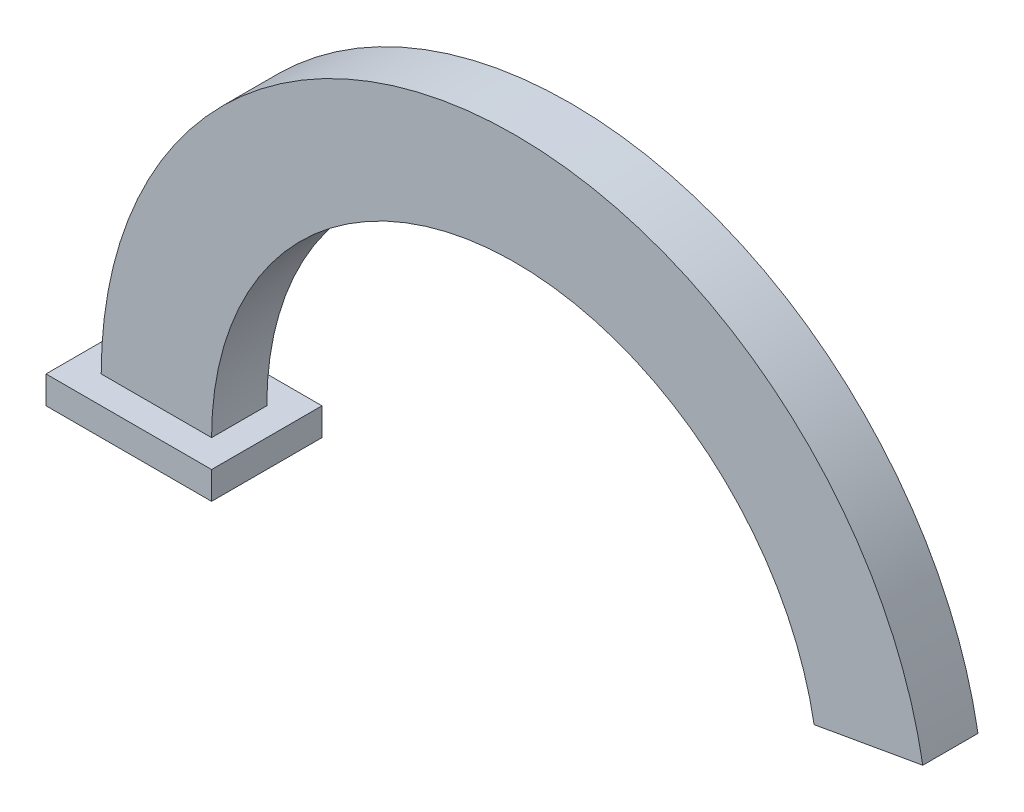
ISO-10303-21;
HEADER;
FILE_DESCRIPTION(('STEP AP214'),'2;1');
FILE_NAME('part.step','',(''),(''),'','','');
FILE_SCHEMA(('AUTOMOTIVE_DESIGN { 1 0 10303 214 1 1 1 1 }'));
ENDSEC;
DATA;
#1=APPLICATION_CONTEXT('core data for automotive mechanical design processes');
#2=APPLICATION_PROTOCOL_DEFINITION('international standard','automotive_design',2000,#1);
#3=PRODUCT_CONTEXT('',#1,'mechanical');
#4=PRODUCT('Part','Part','',(#3));
#5=PRODUCT_RELATED_PRODUCT_CATEGORY('part','',(#4));
#6=PRODUCT_DEFINITION_FORMATION('','',#4);
#7=PRODUCT_DEFINITION_CONTEXT('part definition',#1,'design');
#8=PRODUCT_DEFINITION('design','',#6,#7);
#9=PRODUCT_DEFINITION_SHAPE('','',#8);
#10=(LENGTH_UNIT() NAMED_UNIT(*) SI_UNIT(.MILLI.,.METRE.));
#11=(NAMED_UNIT(*) PLANE_ANGLE_UNIT() SI_UNIT($,.RADIAN.));
#12=(NAMED_UNIT(*) SI_UNIT($,.STERADIAN.) SOLID_ANGLE_UNIT());
#13=UNCERTAINTY_MEASURE_WITH_UNIT(LENGTH_MEASURE(1.E-05),#10,'distance_accuracy_value','');
#14=(GEOMETRIC_REPRESENTATION_CONTEXT(3) GLOBAL_UNCERTAINTY_ASSIGNED_CONTEXT((#13)) GLOBAL_UNIT_ASSIGNED_CONTEXT((#10,
#11,#12)) REPRESENTATION_CONTEXT('',''));
#15=CARTESIAN_POINT('',(0.,0.,0.));
#16=DIRECTION('',(0.,0.,1.));
#17=DIRECTION('',(1.,0.,0.));
#18=AXIS2_PLACEMENT_3D('',#15,#16,#17);
#19=CARTESIAN_POINT('',(0.,0.,10.));
#20=DIRECTION('',(0.,0.,-1.));
#21=DIRECTION('',(-1.,0.,0.));
#22=AXIS2_PLACEMENT_3D('',#19,#20,#21);
#23=CYLINDRICAL_SURFACE('',#22,55.);
#24=CARTESIAN_POINT('',(0.,0.,0.));
#25=DIRECTION('',(0.,0.,1.));
#26=DIRECTION('',(1.,0.,0.));
#27=AXIS2_PLACEMENT_3D('',#24,#25,#26);
#28=CIRCLE('',#27,55.);
#29=CARTESIAN_POINT('',(54.1644264156715,9.55064977168085,0.));
#30=VERTEX_POINT('',#29);
#31=CARTESIAN_POINT('',(-55.,0.,0.));
#32=VERTEX_POINT('',#31);
#33=EDGE_CURVE('E103',#30,#32,#28,.T.);
#34=ORIENTED_EDGE('',*,*,#33,.F.);
#35=DIRECTION('',(0.,0.,-1.));
#36=VECTOR('',#35,1.);
#37=CARTESIAN_POINT('',(54.1644264156715,9.55064977168085,10.));
#38=LINE('',#37,#36);
#39=CARTESIAN_POINT('',(54.1644264156715,9.55064977168085,10.));
#40=VERTEX_POINT('',#39);
#41=EDGE_CURVE('E11',#40,#30,#38,.T.);
#42=ORIENTED_EDGE('',*,*,#41,.F.);
#43=CARTESIAN_POINT('',(0.,0.,10.));
#44=DIRECTION('',(0.,0.,1.));
#45=DIRECTION('',(1.,0.,0.));
#46=AXIS2_PLACEMENT_3D('',#43,#44,#45);
#47=CIRCLE('',#46,55.);
#48=CARTESIAN_POINT('',(-55.,0.,10.));
#49=VERTEX_POINT('',#48);
#50=EDGE_CURVE('E105',#40,#49,#47,.T.);
#51=ORIENTED_EDGE('',*,*,#50,.T.);
#52=DIRECTION('',(0.,0.,-1.));
#53=VECTOR('',#52,1.);
#54=CARTESIAN_POINT('',(-55.,0.,10.));
#55=LINE('',#54,#53);
#56=EDGE_CURVE('E92',#49,#32,#55,.T.);
#57=ORIENTED_EDGE('',*,*,#56,.T.);
#58=EDGE_LOOP('',(#34,#42,#51,#57));
#59=FACE_BOUND('',#58,.T.);
#60=ADVANCED_FACE('F41',(#59),#23,.F.);
#61=CARTESIAN_POINT('',(0.,0.,10.));
#62=DIRECTION('',(-0.173648177666924,0.984807753012209,0.));
#63=DIRECTION('',(-0.984807753012209,-0.173648177666924,0.));
#64=AXIS2_PLACEMENT_3D('',#61,#62,#63);
#65=PLANE('',#64);
#66=DIRECTION('',(0.984807753012209,0.173648177666925,0.));
#67=VECTOR('',#66,1.);
#68=CARTESIAN_POINT('',(0.,0.,0.));
#69=LINE('',#68,#67);
#70=CARTESIAN_POINT('',(73.8605814759157,13.0236133250193,0.));
#71=VERTEX_POINT('',#70);
#72=EDGE_CURVE('E70',#30,#71,#69,.T.);
#73=ORIENTED_EDGE('',*,*,#72,.T.);
#74=DIRECTION('',(0.,0.,-1.));
#75=VECTOR('',#74,1.);
#76=CARTESIAN_POINT('',(73.8605814759157,13.0236133250193,10.));
#77=LINE('',#76,#75);
#78=CARTESIAN_POINT('',(73.8605814759157,13.0236133250193,10.));
#79=VERTEX_POINT('',#78);
#80=EDGE_CURVE('E50',#79,#71,#77,.T.);
#81=ORIENTED_EDGE('',*,*,#80,.F.);
#82=DIRECTION('',(0.984807753012209,0.173648177666925,0.));
#83=VECTOR('',#82,1.);
#84=CARTESIAN_POINT('',(0.,0.,10.));
#85=LINE('',#84,#83);
#86=EDGE_CURVE('E58',#40,#79,#85,.T.);
#87=ORIENTED_EDGE('',*,*,#86,.F.);
#88=ORIENTED_EDGE('',*,*,#41,.T.);
#89=EDGE_LOOP('',(#73,#81,#87,#88));
#90=FACE_BOUND('',#89,.T.);
#91=ADVANCED_FACE('F205',(#90),#65,.F.);
#92=CARTESIAN_POINT('',(0.,0.,10.));
#93=DIRECTION('',(0.,0.,-1.));
#94=DIRECTION('',(-1.,0.,0.));
#95=AXIS2_PLACEMENT_3D('',#92,#93,#94);
#96=CYLINDRICAL_SURFACE('',#95,75.);
#97=CARTESIAN_POINT('',(0.,0.,0.));
#98=DIRECTION('',(0.,0.,1.));
#99=DIRECTION('',(1.,0.,0.));
#100=AXIS2_PLACEMENT_3D('',#97,#98,#99);
#101=CIRCLE('',#100,75.);
#102=CARTESIAN_POINT('',(-75.,0.,0.));
#103=VERTEX_POINT('',#102);
#104=EDGE_CURVE('E95',#71,#103,#101,.T.);
#105=ORIENTED_EDGE('',*,*,#104,.T.);
#106=DIRECTION('',(0.,0.,-1.));
#107=VECTOR('',#106,1.);
#108=CARTESIAN_POINT('',(-75.,0.,10.));
#109=LINE('',#108,#107);
#110=CARTESIAN_POINT('',(-75.,0.,10.));
#111=VERTEX_POINT('',#110);
#112=EDGE_CURVE('E77',#111,#103,#109,.T.);
#113=ORIENTED_EDGE('',*,*,#112,.F.);
#114=CARTESIAN_POINT('',(0.,0.,10.));
#115=DIRECTION('',(0.,0.,1.));
#116=DIRECTION('',(1.,0.,0.));
#117=AXIS2_PLACEMENT_3D('',#114,#115,#116);
#118=CIRCLE('',#117,75.);
#119=EDGE_CURVE('E116',#79,#111,#118,.T.);
#120=ORIENTED_EDGE('',*,*,#119,.F.);
#121=ORIENTED_EDGE('',*,*,#80,.T.);
#122=EDGE_LOOP('',(#105,#113,#120,#121));
#123=FACE_BOUND('',#122,.T.);
#124=ADVANCED_FACE('F96',(#123),#96,.T.);
#125=CARTESIAN_POINT('',(0.,0.,10.));
#126=DIRECTION('',(0.,0.,1.));
#127=DIRECTION('',(1.,0.,0.));
#128=AXIS2_PLACEMENT_3D('',#125,#126,#127);
#129=PLANE('',#128);
#130=ORIENTED_EDGE('',*,*,#50,.F.);
#131=ORIENTED_EDGE('',*,*,#86,.T.);
#132=ORIENTED_EDGE('',*,*,#119,.T.);
#133=DIRECTION('',(-1.,0.,0.));
#134=VECTOR('',#133,1.);
#135=CARTESIAN_POINT('',(0.,0.,10.));
#136=LINE('',#135,#134);
#137=EDGE_CURVE('E88',#49,#111,#136,.T.);
#138=ORIENTED_EDGE('',*,*,#137,.F.);
#139=EDGE_LOOP('',(#130,#131,#132,#138));
#140=FACE_BOUND('',#139,.T.);
#141=ADVANCED_FACE('F197',(#140),#129,.T.);
#142=CARTESIAN_POINT('',(0.,0.,0.));
#143=DIRECTION('',(0.,0.,1.));
#144=DIRECTION('',(1.,0.,0.));
#145=AXIS2_PLACEMENT_3D('',#142,#143,#144);
#146=PLANE('',#145);
#147=ORIENTED_EDGE('',*,*,#33,.T.);
#148=DIRECTION('',(-1.,0.,0.));
#149=VECTOR('',#148,1.);
#150=CARTESIAN_POINT('',(0.,0.,0.));
#151=LINE('',#150,#149);
#152=EDGE_CURVE('E84',#32,#103,#151,.T.);
#153=ORIENTED_EDGE('',*,*,#152,.T.);
#154=ORIENTED_EDGE('',*,*,#104,.F.);
#155=ORIENTED_EDGE('',*,*,#72,.F.);
#156=EDGE_LOOP('',(#147,#153,#154,#155));
#157=FACE_BOUND('',#156,.T.);
#158=ADVANCED_FACE('F101',(#157),#146,.F.);
#159=CARTESIAN_POINT('',(-50.,-5.,0.));
#160=DIRECTION('',(1.,0.,0.));
#161=DIRECTION('',(0.,0.,-1.));
#162=AXIS2_PLACEMENT_3D('',#159,#160,#161);
#163=PLANE('',#162);
#164=DIRECTION('',(0.,0.,-1.));
#165=VECTOR('',#164,1.);
#166=CARTESIAN_POINT('',(-50.,0.,0.));
#167=LINE('',#166,#165);
#168=CARTESIAN_POINT('',(-50.,0.,15.));
#169=VERTEX_POINT('',#168);
#170=CARTESIAN_POINT('',(-50.,0.,-5.));
#171=VERTEX_POINT('',#170);
#172=EDGE_CURVE('E168',#169,#171,#167,.T.);
#173=ORIENTED_EDGE('',*,*,#172,.F.);
#174=DIRECTION('',(0.,1.,0.));
#175=VECTOR('',#174,1.);
#176=CARTESIAN_POINT('',(-50.,-5.,15.));
#177=LINE('',#176,#175);
#178=CARTESIAN_POINT('',(-50.,-5.,15.));
#179=VERTEX_POINT('',#178);
#180=EDGE_CURVE('E124',#179,#169,#177,.T.);
#181=ORIENTED_EDGE('',*,*,#180,.F.);
#182=DIRECTION('',(0.,0.,-1.));
#183=VECTOR('',#182,1.);
#184=CARTESIAN_POINT('',(-50.,-5.,0.));
#185=LINE('',#184,#183);
#186=CARTESIAN_POINT('',(-50.,-5.,-5.));
#187=VERTEX_POINT('',#186);
#188=EDGE_CURVE('E152',#179,#187,#185,.T.);
#189=ORIENTED_EDGE('',*,*,#188,.T.);
#190=DIRECTION('',(0.,1.,0.));
#191=VECTOR('',#190,1.);
#192=CARTESIAN_POINT('',(-50.,-5.,-5.));
#193=LINE('',#192,#191);
#194=EDGE_CURVE('E136',#187,#171,#193,.T.);
#195=ORIENTED_EDGE('',*,*,#194,.T.);
#196=EDGE_LOOP('',(#173,#181,#189,#195));
#197=FACE_BOUND('',#196,.T.);
#198=ADVANCED_FACE('F183',(#197),#163,.T.);
#199=CARTESIAN_POINT('',(0.,-5.,15.));
#200=DIRECTION('',(0.,0.,1.));
#201=DIRECTION('',(1.,0.,0.));
#202=AXIS2_PLACEMENT_3D('',#199,#200,#201);
#203=PLANE('',#202);
#204=DIRECTION('',(1.,0.,0.));
#205=VECTOR('',#204,1.);
#206=CARTESIAN_POINT('',(0.,0.,15.));
#207=LINE('',#206,#205);
#208=CARTESIAN_POINT('',(-80.,0.,15.));
#209=VERTEX_POINT('',#208);
#210=EDGE_CURVE('E164',#209,#169,#207,.T.);
#211=ORIENTED_EDGE('',*,*,#210,.F.);
#212=DIRECTION('',(0.,1.,0.));
#213=VECTOR('',#212,1.);
#214=CARTESIAN_POINT('',(-80.,-5.,15.));
#215=LINE('',#214,#213);
#216=CARTESIAN_POINT('',(-80.,-5.,15.));
#217=VERTEX_POINT('',#216);
#218=EDGE_CURVE('E129',#217,#209,#215,.T.);
#219=ORIENTED_EDGE('',*,*,#218,.F.);
#220=DIRECTION('',(1.,0.,0.));
#221=VECTOR('',#220,1.);
#222=CARTESIAN_POINT('',(0.,-5.,15.));
#223=LINE('',#222,#221);
#224=EDGE_CURVE('E148',#217,#179,#223,.T.);
#225=ORIENTED_EDGE('',*,*,#224,.T.);
#226=ORIENTED_EDGE('',*,*,#180,.T.);
#227=EDGE_LOOP('',(#211,#219,#225,#226));
#228=FACE_BOUND('',#227,.T.);
#229=ADVANCED_FACE('F240',(#228),#203,.T.);
#230=CARTESIAN_POINT('',(-80.,-5.,0.));
#231=DIRECTION('',(1.,0.,0.));
#232=DIRECTION('',(0.,0.,-1.));
#233=AXIS2_PLACEMENT_3D('',#230,#231,#232);
#234=PLANE('',#233);
#235=DIRECTION('',(0.,0.,-1.));
#236=VECTOR('',#235,1.);
#237=CARTESIAN_POINT('',(-80.,0.,0.));
#238=LINE('',#237,#236);
#239=CARTESIAN_POINT('',(-80.,0.,-5.));
#240=VERTEX_POINT('',#239);
#241=EDGE_CURVE('E160',#209,#240,#238,.T.);
#242=ORIENTED_EDGE('',*,*,#241,.T.);
#243=DIRECTION('',(0.,1.,0.));
#244=VECTOR('',#243,1.);
#245=CARTESIAN_POINT('',(-80.,-5.,-5.));
#246=LINE('',#245,#244);
#247=CARTESIAN_POINT('',(-80.,-5.,-5.));
#248=VERTEX_POINT('',#247);
#249=EDGE_CURVE('E132',#248,#240,#246,.T.);
#250=ORIENTED_EDGE('',*,*,#249,.F.);
#251=DIRECTION('',(0.,0.,-1.));
#252=VECTOR('',#251,1.);
#253=CARTESIAN_POINT('',(-80.,-5.,0.));
#254=LINE('',#253,#252);
#255=EDGE_CURVE('E144',#217,#248,#254,.T.);
#256=ORIENTED_EDGE('',*,*,#255,.F.);
#257=ORIENTED_EDGE('',*,*,#218,.T.);
#258=EDGE_LOOP('',(#242,#250,#256,#257));
#259=FACE_BOUND('',#258,.T.);
#260=ADVANCED_FACE('F248',(#259),#234,.F.);
#261=CARTESIAN_POINT('',(0.,-5.,-5.));
#262=DIRECTION('',(0.,0.,1.));
#263=DIRECTION('',(1.,0.,0.));
#264=AXIS2_PLACEMENT_3D('',#261,#262,#263);
#265=PLANE('',#264);
#266=DIRECTION('',(1.,0.,0.));
#267=VECTOR('',#266,1.);
#268=CARTESIAN_POINT('',(0.,0.,-5.));
#269=LINE('',#268,#267);
#270=EDGE_CURVE('E156',#240,#171,#269,.T.);
#271=ORIENTED_EDGE('',*,*,#270,.T.);
#272=ORIENTED_EDGE('',*,*,#194,.F.);
#273=DIRECTION('',(1.,0.,0.));
#274=VECTOR('',#273,1.);
#275=CARTESIAN_POINT('',(0.,-5.,-5.));
#276=LINE('',#275,#274);
#277=EDGE_CURVE('E140',#248,#187,#276,.T.);
#278=ORIENTED_EDGE('',*,*,#277,.F.);
#279=ORIENTED_EDGE('',*,*,#249,.T.);
#280=EDGE_LOOP('',(#271,#272,#278,#279));
#281=FACE_BOUND('',#280,.T.);
#282=ADVANCED_FACE('F257',(#281),#265,.F.);
#283=CARTESIAN_POINT('',(0.,-5.,0.));
#284=DIRECTION('',(0.,-1.,0.));
#285=DIRECTION('',(0.,0.,-1.));
#286=AXIS2_PLACEMENT_3D('',#283,#284,#285);
#287=PLANE('',#286);
#288=ORIENTED_EDGE('',*,*,#188,.F.);
#289=ORIENTED_EDGE('',*,*,#224,.F.);
#290=ORIENTED_EDGE('',*,*,#255,.T.);
#291=ORIENTED_EDGE('',*,*,#277,.T.);
#292=EDGE_LOOP('',(#288,#289,#290,#291));
#293=FACE_BOUND('',#292,.T.);
#294=ADVANCED_FACE('F267',(#293),#287,.T.);
#295=CARTESIAN_POINT('',(0.,0.,0.));
#296=DIRECTION('',(0.,-1.,0.));
#297=DIRECTION('',(0.,0.,-1.));
#298=AXIS2_PLACEMENT_3D('',#295,#296,#297);
#299=PLANE('',#298);
#300=ORIENTED_EDGE('',*,*,#137,.T.);
#301=ORIENTED_EDGE('',*,*,#112,.T.);
#302=ORIENTED_EDGE('',*,*,#152,.F.);
#303=ORIENTED_EDGE('',*,*,#56,.F.);
#304=EDGE_LOOP('',(#300,#301,#302,#303));
#305=FACE_BOUND('',#304,.T.);
#306=ORIENTED_EDGE('',*,*,#172,.T.);
#307=ORIENTED_EDGE('',*,*,#270,.F.);
#308=ORIENTED_EDGE('',*,*,#241,.F.);
#309=ORIENTED_EDGE('',*,*,#210,.T.);
#310=EDGE_LOOP('',(#306,#307,#308,#309));
#311=FACE_BOUND('',#310,.T.);
#312=ADVANCED_FACE('F79',(#305,#311),#299,.F.);
#313=CLOSED_SHELL('',(#60,#91,#124,#141,#158,#198,#229,#260,#282,#294,#312));
#314=MANIFOLD_SOLID_BREP('B2',#313);
#315=ADVANCED_BREP_SHAPE_REPRESENTATION('',(#18,#314),#14);
#316=SHAPE_DEFINITION_REPRESENTATION(#9,#315);
ENDSEC;
END-ISO-10303-21;
